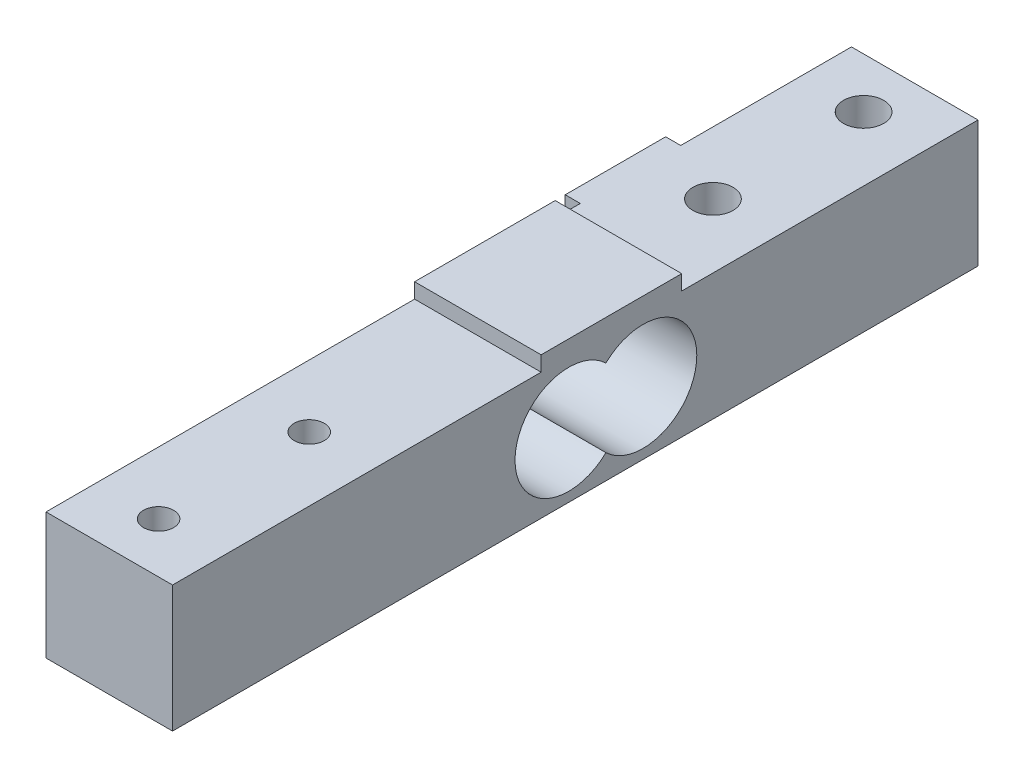
ISO-10303-21;
HEADER;
FILE_DESCRIPTION(('STEP AP214'),'2;1');
FILE_NAME('part.step','',(''),(''),'','','');
FILE_SCHEMA(('AUTOMOTIVE_DESIGN { 1 0 10303 214 1 1 1 1 }'));
ENDSEC;
DATA;
#1=APPLICATION_CONTEXT('core data for automotive mechanical design processes');
#2=APPLICATION_PROTOCOL_DEFINITION('international standard','automotive_design',2000,#1);
#3=PRODUCT_CONTEXT('',#1,'mechanical');
#4=PRODUCT('Part','Part','',(#3));
#5=PRODUCT_RELATED_PRODUCT_CATEGORY('part','',(#4));
#6=PRODUCT_DEFINITION_FORMATION('','',#4);
#7=PRODUCT_DEFINITION_CONTEXT('part definition',#1,'design');
#8=PRODUCT_DEFINITION('design','',#6,#7);
#9=PRODUCT_DEFINITION_SHAPE('','',#8);
#10=(LENGTH_UNIT() NAMED_UNIT(*) SI_UNIT(.MILLI.,.METRE.));
#11=(NAMED_UNIT(*) PLANE_ANGLE_UNIT() SI_UNIT($,.RADIAN.));
#12=(NAMED_UNIT(*) SI_UNIT($,.STERADIAN.) SOLID_ANGLE_UNIT());
#13=UNCERTAINTY_MEASURE_WITH_UNIT(LENGTH_MEASURE(1.E-05),#10,'distance_accuracy_value','');
#14=(GEOMETRIC_REPRESENTATION_CONTEXT(3) GLOBAL_UNCERTAINTY_ASSIGNED_CONTEXT((#13)) GLOBAL_UNIT_ASSIGNED_CONTEXT((#10,
#11,#12)) REPRESENTATION_CONTEXT('',''));
#15=CARTESIAN_POINT('',(0.,0.,0.));
#16=DIRECTION('',(0.,0.,1.));
#17=DIRECTION('',(1.,0.,0.));
#18=AXIS2_PLACEMENT_3D('',#15,#16,#17);
#19=CARTESIAN_POINT('',(0.,0.,80.2));
#20=DIRECTION('',(1.,0.,0.));
#21=DIRECTION('',(0.,1.,0.));
#22=AXIS2_PLACEMENT_3D('',#19,#20,#21);
#23=PLANE('',#22);
#24=CARTESIAN_POINT('',(0.,6.3,33.35));
#25=DIRECTION('',(1.,0.,0.));
#26=DIRECTION('',(0.,1.,0.));
#27=AXIS2_PLACEMENT_3D('',#24,#25,#26);
#28=CIRCLE('',#27,5.35);
#29=CARTESIAN_POINT('',(0.,2.43574069193074,37.05));
#30=VERTEX_POINT('',#29);
#31=CARTESIAN_POINT('',(0.,10.1642593080693,37.05));
#32=VERTEX_POINT('',#31);
#33=EDGE_CURVE('E264',#30,#32,#28,.T.);
#34=ORIENTED_EDGE('',*,*,#33,.T.);
#35=CARTESIAN_POINT('',(0.,6.3,40.75));
#36=DIRECTION('',(1.,0.,0.));
#37=DIRECTION('',(0.,1.,0.));
#38=AXIS2_PLACEMENT_3D('',#35,#36,#37);
#39=CIRCLE('',#38,5.35);
#40=EDGE_CURVE('E261',#32,#30,#39,.T.);
#41=ORIENTED_EDGE('',*,*,#40,.T.);
#42=EDGE_LOOP('',(#34,#41));
#43=FACE_BOUND('',#42,.T.);
#44=DIRECTION('',(0.,1.,0.));
#45=VECTOR('',#44,1.);
#46=CARTESIAN_POINT('',(0.,12.6,27.));
#47=LINE('',#46,#45);
#48=CARTESIAN_POINT('',(0.,0.,27.));
#49=VERTEX_POINT('',#48);
#50=CARTESIAN_POINT('',(0.,12.6,27.));
#51=VERTEX_POINT('',#50);
#52=EDGE_CURVE('E155',#49,#51,#47,.T.);
#53=ORIENTED_EDGE('',*,*,#52,.F.);
#54=DIRECTION('',(0.,0.,-1.));
#55=VECTOR('',#54,1.);
#56=CARTESIAN_POINT('',(0.,0.,80.2));
#57=LINE('',#56,#55);
#58=CARTESIAN_POINT('',(0.,0.,80.2));
#59=VERTEX_POINT('',#58);
#60=EDGE_CURVE('E11',#59,#49,#57,.T.);
#61=ORIENTED_EDGE('',*,*,#60,.F.);
#62=DIRECTION('',(0.,-1.,0.));
#63=VECTOR('',#62,1.);
#64=CARTESIAN_POINT('',(0.,0.,80.2));
#65=LINE('',#64,#63);
#66=CARTESIAN_POINT('',(0.,12.6,80.2));
#67=VERTEX_POINT('',#66);
#68=EDGE_CURVE('E198',#67,#59,#65,.T.);
#69=ORIENTED_EDGE('',*,*,#68,.F.);
#70=DIRECTION('',(0.,0.,-1.));
#71=VECTOR('',#70,1.);
#72=CARTESIAN_POINT('',(0.,12.6,80.2));
#73=LINE('',#72,#71);
#74=CARTESIAN_POINT('',(0.,12.6,43.5));
#75=VERTEX_POINT('',#74);
#76=EDGE_CURVE('E201',#67,#75,#73,.T.);
#77=ORIENTED_EDGE('',*,*,#76,.T.);
#78=DIRECTION('',(0.,-1.,0.));
#79=VECTOR('',#78,1.);
#80=CARTESIAN_POINT('',(0.,14.1,43.5));
#81=LINE('',#80,#79);
#82=CARTESIAN_POINT('',(0.,14.1,43.5));
#83=VERTEX_POINT('',#82);
#84=EDGE_CURVE('E242',#83,#75,#81,.T.);
#85=ORIENTED_EDGE('',*,*,#84,.F.);
#86=DIRECTION('',(0.,0.,1.));
#87=VECTOR('',#86,1.);
#88=CARTESIAN_POINT('',(0.,14.1,43.5));
#89=LINE('',#88,#87);
#90=CARTESIAN_POINT('',(0.,14.1,29.5));
#91=VERTEX_POINT('',#90);
#92=EDGE_CURVE('E327',#91,#83,#89,.T.);
#93=ORIENTED_EDGE('',*,*,#92,.F.);
#94=DIRECTION('',(0.,-1.,0.));
#95=VECTOR('',#94,1.);
#96=CARTESIAN_POINT('',(0.,14.1,29.5));
#97=LINE('',#96,#95);
#98=CARTESIAN_POINT('',(0.,12.6,29.5));
#99=VERTEX_POINT('',#98);
#100=EDGE_CURVE('E244',#91,#99,#97,.T.);
#101=ORIENTED_EDGE('',*,*,#100,.T.);
#102=EDGE_CURVE('E56',#99,#51,#73,.T.);
#103=ORIENTED_EDGE('',*,*,#102,.T.);
#104=EDGE_LOOP('',(#53,#61,#69,#77,#85,#93,#101,#103));
#105=FACE_BOUND('',#104,.T.);
#106=ADVANCED_FACE('F32',(#43,#105),#23,.F.);
#107=DIRECTION('',(0.,-1.,0.));
#108=VECTOR('',#107,1.);
#109=CARTESIAN_POINT('',(0.,12.6,17.));
#110=LINE('',#109,#108);
#111=CARTESIAN_POINT('',(0.,12.6,17.));
#112=VERTEX_POINT('',#111);
#113=CARTESIAN_POINT('',(0.,0.,17.));
#114=VERTEX_POINT('',#113);
#115=EDGE_CURVE('E48',#112,#114,#110,.T.);
#116=ORIENTED_EDGE('',*,*,#115,.F.);
#117=CARTESIAN_POINT('',(0.,12.6,0.));
#118=VERTEX_POINT('',#117);
#119=EDGE_CURVE('E181',#112,#118,#73,.T.);
#120=ORIENTED_EDGE('',*,*,#119,.T.);
#121=DIRECTION('',(0.,-1.,0.));
#122=VECTOR('',#121,1.);
#123=CARTESIAN_POINT('',(0.,0.,0.));
#124=LINE('',#123,#122);
#125=CARTESIAN_POINT('',(0.,0.,0.));
#126=VERTEX_POINT('',#125);
#127=EDGE_CURVE('E218',#118,#126,#124,.T.);
#128=ORIENTED_EDGE('',*,*,#127,.T.);
#129=EDGE_CURVE('E40',#114,#126,#57,.T.);
#130=ORIENTED_EDGE('',*,*,#129,.F.);
#131=EDGE_LOOP('',(#116,#120,#128,#130));
#132=FACE_BOUND('',#131,.T.);
#133=ADVANCED_FACE('F306',(#132),#23,.F.);
#134=CARTESIAN_POINT('',(0.,12.6,80.2));
#135=DIRECTION('',(0.,-1.,0.));
#136=DIRECTION('',(0.,0.,-1.));
#137=AXIS2_PLACEMENT_3D('',#134,#135,#136);
#138=PLANE('',#137);
#139=CARTESIAN_POINT('',(6.20845831409421,12.6,75.2));
#140=DIRECTION('',(0.,1.,0.));
#141=DIRECTION('',(0.,0.,1.));
#142=AXIS2_PLACEMENT_3D('',#139,#140,#141);
#143=CIRCLE('',#142,1.5);
#144=CARTESIAN_POINT('',(6.20845831409421,12.6,76.7));
#145=VERTEX_POINT('',#144);
#146=EDGE_CURVE('E212',#145,#145,#143,.T.);
#147=ORIENTED_EDGE('',*,*,#146,.F.);
#148=EDGE_LOOP('',(#147));
#149=FACE_BOUND('',#148,.T.);
#150=CARTESIAN_POINT('',(6.20845831409421,12.6,60.2));
#151=DIRECTION('',(0.,1.,0.));
#152=DIRECTION('',(0.,0.,1.));
#153=AXIS2_PLACEMENT_3D('',#150,#151,#152);
#154=CIRCLE('',#153,1.5);
#155=CARTESIAN_POINT('',(6.20845831409421,12.6,61.7));
#156=VERTEX_POINT('',#155);
#157=EDGE_CURVE('E288',#156,#156,#154,.T.);
#158=ORIENTED_EDGE('',*,*,#157,.F.);
#159=EDGE_LOOP('',(#158));
#160=FACE_BOUND('',#159,.T.);
#161=DIRECTION('',(1.,0.,0.));
#162=VECTOR('',#161,1.);
#163=CARTESIAN_POINT('',(12.6,12.6,43.5));
#164=LINE('',#163,#162);
#165=CARTESIAN_POINT('',(12.6,12.6,43.5));
#166=VERTEX_POINT('',#165);
#167=EDGE_CURVE('E159',#75,#166,#164,.T.);
#168=ORIENTED_EDGE('',*,*,#167,.F.);
#169=ORIENTED_EDGE('',*,*,#76,.F.);
#170=DIRECTION('',(-1.,0.,0.));
#171=VECTOR('',#170,1.);
#172=CARTESIAN_POINT('',(0.,12.6,80.2));
#173=LINE('',#172,#171);
#174=CARTESIAN_POINT('',(12.6,12.6,80.2));
#175=VERTEX_POINT('',#174);
#176=EDGE_CURVE('E216',#175,#67,#173,.T.);
#177=ORIENTED_EDGE('',*,*,#176,.F.);
#178=DIRECTION('',(0.,0.,-1.));
#179=VECTOR('',#178,1.);
#180=CARTESIAN_POINT('',(12.6,12.6,80.2));
#181=LINE('',#180,#179);
#182=EDGE_CURVE('E312',#175,#166,#181,.T.);
#183=ORIENTED_EDGE('',*,*,#182,.T.);
#184=EDGE_LOOP('',(#168,#169,#177,#183));
#185=FACE_BOUND('',#184,.T.);
#186=ADVANCED_FACE('F303',(#149,#160,#185),#138,.F.);
#187=CARTESIAN_POINT('',(6.20845831409421,12.6,20.));
#188=DIRECTION('',(0.,1.,0.));
#189=DIRECTION('',(0.,0.,1.));
#190=AXIS2_PLACEMENT_3D('',#187,#188,#189);
#191=CIRCLE('',#190,2.);
#192=CARTESIAN_POINT('',(6.20845831409421,12.6,22.));
#193=VERTEX_POINT('',#192);
#194=EDGE_CURVE('E282',#193,#193,#191,.T.);
#195=ORIENTED_EDGE('',*,*,#194,.F.);
#196=EDGE_LOOP('',(#195));
#197=FACE_BOUND('',#196,.T.);
#198=CARTESIAN_POINT('',(6.20845831409421,12.6,5.));
#199=DIRECTION('',(0.,1.,0.));
#200=DIRECTION('',(0.,0.,1.));
#201=AXIS2_PLACEMENT_3D('',#198,#199,#200);
#202=CIRCLE('',#201,2.);
#203=CARTESIAN_POINT('',(6.20845831409421,12.6,7.));
#204=VERTEX_POINT('',#203);
#205=EDGE_CURVE('E276',#204,#204,#202,.T.);
#206=ORIENTED_EDGE('',*,*,#205,.F.);
#207=EDGE_LOOP('',(#206));
#208=FACE_BOUND('',#207,.T.);
#209=DIRECTION('',(-1.,0.,0.));
#210=VECTOR('',#209,1.);
#211=CARTESIAN_POINT('',(12.6,12.6,29.5));
#212=LINE('',#211,#210);
#213=CARTESIAN_POINT('',(12.6,12.6,29.5));
#214=VERTEX_POINT('',#213);
#215=EDGE_CURVE('E156',#214,#99,#212,.T.);
#216=ORIENTED_EDGE('',*,*,#215,.F.);
#217=CARTESIAN_POINT('',(12.6,12.6,0.));
#218=VERTEX_POINT('',#217);
#219=EDGE_CURVE('E235',#214,#218,#181,.T.);
#220=ORIENTED_EDGE('',*,*,#219,.T.);
#221=DIRECTION('',(-1.,0.,0.));
#222=VECTOR('',#221,1.);
#223=CARTESIAN_POINT('',(0.,12.6,0.));
#224=LINE('',#223,#222);
#225=EDGE_CURVE('E204',#218,#118,#224,.T.);
#226=ORIENTED_EDGE('',*,*,#225,.T.);
#227=ORIENTED_EDGE('',*,*,#119,.F.);
#228=DIRECTION('',(1.,0.,0.));
#229=VECTOR('',#228,1.);
#230=CARTESIAN_POINT('',(-1.5,12.6,17.));
#231=LINE('',#230,#229);
#232=CARTESIAN_POINT('',(-1.5,12.6,17.));
#233=VERTEX_POINT('',#232);
#234=EDGE_CURVE('E140',#233,#112,#231,.T.);
#235=ORIENTED_EDGE('',*,*,#234,.F.);
#236=DIRECTION('',(0.,0.,-1.));
#237=VECTOR('',#236,1.);
#238=CARTESIAN_POINT('',(-1.5,12.6,27.));
#239=LINE('',#238,#237);
#240=CARTESIAN_POINT('',(-1.5,12.6,27.));
#241=VERTEX_POINT('',#240);
#242=EDGE_CURVE('E133',#241,#233,#239,.T.);
#243=ORIENTED_EDGE('',*,*,#242,.F.);
#244=DIRECTION('',(1.,0.,0.));
#245=VECTOR('',#244,1.);
#246=CARTESIAN_POINT('',(-1.5,12.6,27.));
#247=LINE('',#246,#245);
#248=EDGE_CURVE('E137',#241,#51,#247,.T.);
#249=ORIENTED_EDGE('',*,*,#248,.T.);
#250=ORIENTED_EDGE('',*,*,#102,.F.);
#251=EDGE_LOOP('',(#216,#220,#226,#227,#235,#243,#249,#250));
#252=FACE_BOUND('',#251,.T.);
#253=ADVANCED_FACE('F135',(#197,#208,#252),#138,.F.);
#254=CARTESIAN_POINT('',(0.,0.,80.2));
#255=DIRECTION('',(0.,1.,0.));
#256=DIRECTION('',(0.,0.,1.));
#257=AXIS2_PLACEMENT_3D('',#254,#255,#256);
#258=PLANE('',#257);
#259=CARTESIAN_POINT('',(6.20845831409421,0.,5.));
#260=DIRECTION('',(0.,1.,0.));
#261=DIRECTION('',(0.,0.,1.));
#262=AXIS2_PLACEMENT_3D('',#259,#260,#261);
#263=CIRCLE('',#262,2.);
#264=CARTESIAN_POINT('',(6.20845831409421,0.,7.));
#265=VERTEX_POINT('',#264);
#266=EDGE_CURVE('E279',#265,#265,#263,.T.);
#267=ORIENTED_EDGE('',*,*,#266,.T.);
#268=EDGE_LOOP('',(#267));
#269=FACE_BOUND('',#268,.T.);
#270=CARTESIAN_POINT('',(6.20845831409421,0.,20.));
#271=DIRECTION('',(0.,1.,0.));
#272=DIRECTION('',(0.,0.,1.));
#273=AXIS2_PLACEMENT_3D('',#270,#271,#272);
#274=CIRCLE('',#273,2.);
#275=CARTESIAN_POINT('',(6.20845831409421,0.,22.));
#276=VERTEX_POINT('',#275);
#277=EDGE_CURVE('E285',#276,#276,#274,.T.);
#278=ORIENTED_EDGE('',*,*,#277,.T.);
#279=EDGE_LOOP('',(#278));
#280=FACE_BOUND('',#279,.T.);
#281=CARTESIAN_POINT('',(6.20845831409421,0.,60.2));
#282=DIRECTION('',(0.,1.,0.));
#283=DIRECTION('',(0.,0.,1.));
#284=AXIS2_PLACEMENT_3D('',#281,#282,#283);
#285=CIRCLE('',#284,1.5);
#286=CARTESIAN_POINT('',(6.20845831409421,0.,61.7));
#287=VERTEX_POINT('',#286);
#288=EDGE_CURVE('E291',#287,#287,#285,.T.);
#289=ORIENTED_EDGE('',*,*,#288,.T.);
#290=EDGE_LOOP('',(#289));
#291=FACE_BOUND('',#290,.T.);
#292=CARTESIAN_POINT('',(6.20845831409421,0.,75.2));
#293=DIRECTION('',(0.,1.,0.));
#294=DIRECTION('',(0.,0.,1.));
#295=AXIS2_PLACEMENT_3D('',#292,#293,#294);
#296=CIRCLE('',#295,1.5);
#297=CARTESIAN_POINT('',(6.20845831409421,0.,76.7));
#298=VERTEX_POINT('',#297);
#299=EDGE_CURVE('E222',#298,#298,#296,.T.);
#300=ORIENTED_EDGE('',*,*,#299,.T.);
#301=EDGE_LOOP('',(#300));
#302=FACE_BOUND('',#301,.T.);
#303=DIRECTION('',(1.,0.,0.));
#304=VECTOR('',#303,1.);
#305=CARTESIAN_POINT('',(0.,0.,0.));
#306=LINE('',#305,#304);
#307=CARTESIAN_POINT('',(12.6,0.,0.));
#308=VERTEX_POINT('',#307);
#309=EDGE_CURVE('E221',#126,#308,#306,.T.);
#310=ORIENTED_EDGE('',*,*,#309,.T.);
#311=DIRECTION('',(0.,0.,-1.));
#312=VECTOR('',#311,1.);
#313=CARTESIAN_POINT('',(12.6,0.,80.2));
#314=LINE('',#313,#312);
#315=CARTESIAN_POINT('',(12.6,0.,80.2));
#316=VERTEX_POINT('',#315);
#317=EDGE_CURVE('E237',#316,#308,#314,.T.);
#318=ORIENTED_EDGE('',*,*,#317,.F.);
#319=DIRECTION('',(1.,0.,0.));
#320=VECTOR('',#319,1.);
#321=CARTESIAN_POINT('',(0.,0.,80.2));
#322=LINE('',#321,#320);
#323=EDGE_CURVE('E194',#59,#316,#322,.T.);
#324=ORIENTED_EDGE('',*,*,#323,.F.);
#325=ORIENTED_EDGE('',*,*,#60,.T.);
#326=DIRECTION('',(1.,0.,0.));
#327=VECTOR('',#326,1.);
#328=CARTESIAN_POINT('',(-1.5,0.,27.));
#329=LINE('',#328,#327);
#330=CARTESIAN_POINT('',(-1.5,0.,27.));
#331=VERTEX_POINT('',#330);
#332=EDGE_CURVE('E169',#331,#49,#329,.T.);
#333=ORIENTED_EDGE('',*,*,#332,.F.);
#334=DIRECTION('',(0.,0.,1.));
#335=VECTOR('',#334,1.);
#336=CARTESIAN_POINT('',(-1.5,0.,27.));
#337=LINE('',#336,#335);
#338=CARTESIAN_POINT('',(-1.5,0.,17.));
#339=VERTEX_POINT('',#338);
#340=EDGE_CURVE('E149',#339,#331,#337,.T.);
#341=ORIENTED_EDGE('',*,*,#340,.F.);
#342=DIRECTION('',(1.,0.,0.));
#343=VECTOR('',#342,1.);
#344=CARTESIAN_POINT('',(-1.5,0.,17.));
#345=LINE('',#344,#343);
#346=EDGE_CURVE('E161',#339,#114,#345,.T.);
#347=ORIENTED_EDGE('',*,*,#346,.T.);
#348=ORIENTED_EDGE('',*,*,#129,.T.);
#349=EDGE_LOOP('',(#310,#318,#324,#325,#333,#341,#347,#348));
#350=FACE_BOUND('',#349,.T.);
#351=ADVANCED_FACE('F191',(#269,#280,#291,#302,#350),#258,.F.);
#352=CARTESIAN_POINT('',(12.6,0.,80.2));
#353=DIRECTION('',(-1.,0.,0.));
#354=DIRECTION('',(0.,-1.,0.));
#355=AXIS2_PLACEMENT_3D('',#352,#353,#354);
#356=PLANE('',#355);
#357=CARTESIAN_POINT('',(12.6,6.3,33.35));
#358=DIRECTION('',(1.,0.,0.));
#359=DIRECTION('',(0.,1.,0.));
#360=AXIS2_PLACEMENT_3D('',#357,#358,#359);
#361=CIRCLE('',#360,5.35);
#362=CARTESIAN_POINT('',(12.6,2.43574069193074,37.05));
#363=VERTEX_POINT('',#362);
#364=CARTESIAN_POINT('',(12.6,10.1642593080693,37.05));
#365=VERTEX_POINT('',#364);
#366=EDGE_CURVE('E265',#363,#365,#361,.T.);
#367=ORIENTED_EDGE('',*,*,#366,.F.);
#368=CARTESIAN_POINT('',(12.6,6.3,40.75));
#369=DIRECTION('',(1.,0.,0.));
#370=DIRECTION('',(0.,1.,0.));
#371=AXIS2_PLACEMENT_3D('',#368,#369,#370);
#372=CIRCLE('',#371,5.35);
#373=EDGE_CURVE('E269',#365,#363,#372,.T.);
#374=ORIENTED_EDGE('',*,*,#373,.F.);
#375=EDGE_LOOP('',(#367,#374));
#376=FACE_BOUND('',#375,.T.);
#377=DIRECTION('',(0.,1.,0.));
#378=VECTOR('',#377,1.);
#379=CARTESIAN_POINT('',(12.6,0.,0.));
#380=LINE('',#379,#378);
#381=EDGE_CURVE('E209',#308,#218,#380,.T.);
#382=ORIENTED_EDGE('',*,*,#381,.T.);
#383=ORIENTED_EDGE('',*,*,#219,.F.);
#384=DIRECTION('',(0.,-1.,0.));
#385=VECTOR('',#384,1.);
#386=CARTESIAN_POINT('',(12.6,14.1,29.5));
#387=LINE('',#386,#385);
#388=CARTESIAN_POINT('',(12.6,14.1,29.5));
#389=VERTEX_POINT('',#388);
#390=EDGE_CURVE('E271',#389,#214,#387,.T.);
#391=ORIENTED_EDGE('',*,*,#390,.F.);
#392=DIRECTION('',(0.,0.,-1.));
#393=VECTOR('',#392,1.);
#394=CARTESIAN_POINT('',(12.6,14.1,43.5));
#395=LINE('',#394,#393);
#396=CARTESIAN_POINT('',(12.6,14.1,43.5));
#397=VERTEX_POINT('',#396);
#398=EDGE_CURVE('E176',#397,#389,#395,.T.);
#399=ORIENTED_EDGE('',*,*,#398,.F.);
#400=DIRECTION('',(0.,-1.,0.));
#401=VECTOR('',#400,1.);
#402=CARTESIAN_POINT('',(12.6,14.1,43.5));
#403=LINE('',#402,#401);
#404=EDGE_CURVE('E245',#397,#166,#403,.T.);
#405=ORIENTED_EDGE('',*,*,#404,.T.);
#406=ORIENTED_EDGE('',*,*,#182,.F.);
#407=DIRECTION('',(0.,1.,0.));
#408=VECTOR('',#407,1.);
#409=CARTESIAN_POINT('',(12.6,0.,80.2));
#410=LINE('',#409,#408);
#411=EDGE_CURVE('E206',#316,#175,#410,.T.);
#412=ORIENTED_EDGE('',*,*,#411,.F.);
#413=ORIENTED_EDGE('',*,*,#317,.T.);
#414=EDGE_LOOP('',(#382,#383,#391,#399,#405,#406,#412,#413));
#415=FACE_BOUND('',#414,.T.);
#416=ADVANCED_FACE('F319',(#376,#415),#356,.F.);
#417=CARTESIAN_POINT('',(0.,0.,80.2));
#418=DIRECTION('',(0.,0.,-1.));
#419=DIRECTION('',(-1.,0.,0.));
#420=AXIS2_PLACEMENT_3D('',#417,#418,#419);
#421=PLANE('',#420);
#422=ORIENTED_EDGE('',*,*,#68,.T.);
#423=ORIENTED_EDGE('',*,*,#323,.T.);
#424=ORIENTED_EDGE('',*,*,#411,.T.);
#425=ORIENTED_EDGE('',*,*,#176,.T.);
#426=EDGE_LOOP('',(#422,#423,#424,#425));
#427=FACE_BOUND('',#426,.T.);
#428=ADVANCED_FACE('F368',(#427),#421,.F.);
#429=CARTESIAN_POINT('',(0.,0.,0.));
#430=DIRECTION('',(0.,0.,-1.));
#431=DIRECTION('',(-1.,0.,0.));
#432=AXIS2_PLACEMENT_3D('',#429,#430,#431);
#433=PLANE('',#432);
#434=ORIENTED_EDGE('',*,*,#127,.F.);
#435=ORIENTED_EDGE('',*,*,#225,.F.);
#436=ORIENTED_EDGE('',*,*,#381,.F.);
#437=ORIENTED_EDGE('',*,*,#309,.F.);
#438=EDGE_LOOP('',(#434,#435,#436,#437));
#439=FACE_BOUND('',#438,.T.);
#440=ADVANCED_FACE('F342',(#439),#433,.T.);
#441=CARTESIAN_POINT('',(6.20845831409421,0.,75.2));
#442=DIRECTION('',(0.,1.,0.));
#443=DIRECTION('',(0.,0.,1.));
#444=AXIS2_PLACEMENT_3D('',#441,#442,#443);
#445=CYLINDRICAL_SURFACE('',#444,1.5);
#446=ORIENTED_EDGE('',*,*,#299,.F.);
#447=EDGE_LOOP('',(#446));
#448=FACE_BOUND('',#447,.T.);
#449=ORIENTED_EDGE('',*,*,#146,.T.);
#450=EDGE_LOOP('',(#449));
#451=FACE_BOUND('',#450,.T.);
#452=ADVANCED_FACE('F301',(#448,#451),#445,.F.);
#453=CARTESIAN_POINT('',(6.20845831409421,0.,60.2));
#454=DIRECTION('',(0.,1.,0.));
#455=DIRECTION('',(0.,0.,1.));
#456=AXIS2_PLACEMENT_3D('',#453,#454,#455);
#457=CYLINDRICAL_SURFACE('',#456,1.5);
#458=ORIENTED_EDGE('',*,*,#288,.F.);
#459=EDGE_LOOP('',(#458));
#460=FACE_BOUND('',#459,.T.);
#461=ORIENTED_EDGE('',*,*,#157,.T.);
#462=EDGE_LOOP('',(#461));
#463=FACE_BOUND('',#462,.T.);
#464=ADVANCED_FACE('F381',(#460,#463),#457,.F.);
#465=CARTESIAN_POINT('',(6.20845831409421,0.,20.));
#466=DIRECTION('',(0.,1.,0.));
#467=DIRECTION('',(0.,0.,1.));
#468=AXIS2_PLACEMENT_3D('',#465,#466,#467);
#469=CYLINDRICAL_SURFACE('',#468,2.);
#470=ORIENTED_EDGE('',*,*,#277,.F.);
#471=EDGE_LOOP('',(#470));
#472=FACE_BOUND('',#471,.T.);
#473=ORIENTED_EDGE('',*,*,#194,.T.);
#474=EDGE_LOOP('',(#473));
#475=FACE_BOUND('',#474,.T.);
#476=ADVANCED_FACE('F385',(#472,#475),#469,.F.);
#477=CARTESIAN_POINT('',(6.20845831409421,0.,5.));
#478=DIRECTION('',(0.,1.,0.));
#479=DIRECTION('',(0.,0.,1.));
#480=AXIS2_PLACEMENT_3D('',#477,#478,#479);
#481=CYLINDRICAL_SURFACE('',#480,2.);
#482=ORIENTED_EDGE('',*,*,#266,.F.);
#483=EDGE_LOOP('',(#482));
#484=FACE_BOUND('',#483,.T.);
#485=ORIENTED_EDGE('',*,*,#205,.T.);
#486=EDGE_LOOP('',(#485));
#487=FACE_BOUND('',#486,.T.);
#488=ADVANCED_FACE('F389',(#484,#487),#481,.F.);
#489=CARTESIAN_POINT('',(0.,6.3,40.75));
#490=DIRECTION('',(1.,0.,0.));
#491=DIRECTION('',(0.,1.,0.));
#492=AXIS2_PLACEMENT_3D('',#489,#490,#491);
#493=CYLINDRICAL_SURFACE('',#492,5.35);
#494=ORIENTED_EDGE('',*,*,#373,.T.);
#495=DIRECTION('',(1.,0.,0.));
#496=VECTOR('',#495,1.);
#497=CARTESIAN_POINT('',(0.,2.43574069193074,37.05));
#498=LINE('',#497,#496);
#499=EDGE_CURVE('E268',#30,#363,#498,.T.);
#500=ORIENTED_EDGE('',*,*,#499,.F.);
#501=ORIENTED_EDGE('',*,*,#40,.F.);
#502=DIRECTION('',(1.,0.,0.));
#503=VECTOR('',#502,1.);
#504=CARTESIAN_POINT('',(0.,10.1642593080693,37.05));
#505=LINE('',#504,#503);
#506=EDGE_CURVE('E274',#32,#365,#505,.T.);
#507=ORIENTED_EDGE('',*,*,#506,.T.);
#508=EDGE_LOOP('',(#494,#500,#501,#507));
#509=FACE_BOUND('',#508,.T.);
#510=ADVANCED_FACE('F353',(#509),#493,.F.);
#511=CARTESIAN_POINT('',(0.,6.3,33.35));
#512=DIRECTION('',(1.,0.,0.));
#513=DIRECTION('',(0.,1.,0.));
#514=AXIS2_PLACEMENT_3D('',#511,#512,#513);
#515=CYLINDRICAL_SURFACE('',#514,5.35);
#516=ORIENTED_EDGE('',*,*,#366,.T.);
#517=ORIENTED_EDGE('',*,*,#506,.F.);
#518=ORIENTED_EDGE('',*,*,#33,.F.);
#519=ORIENTED_EDGE('',*,*,#499,.T.);
#520=EDGE_LOOP('',(#516,#517,#518,#519));
#521=FACE_BOUND('',#520,.T.);
#522=ADVANCED_FACE('F346',(#521),#515,.F.);
#523=CARTESIAN_POINT('',(12.6,14.1,29.5));
#524=DIRECTION('',(0.,0.,1.));
#525=DIRECTION('',(1.,0.,0.));
#526=AXIS2_PLACEMENT_3D('',#523,#524,#525);
#527=PLANE('',#526);
#528=ORIENTED_EDGE('',*,*,#215,.T.);
#529=ORIENTED_EDGE('',*,*,#100,.F.);
#530=DIRECTION('',(-1.,0.,0.));
#531=VECTOR('',#530,1.);
#532=CARTESIAN_POINT('',(12.6,14.1,29.5));
#533=LINE('',#532,#531);
#534=EDGE_CURVE('E326',#389,#91,#533,.T.);
#535=ORIENTED_EDGE('',*,*,#534,.F.);
#536=ORIENTED_EDGE('',*,*,#390,.T.);
#537=EDGE_LOOP('',(#528,#529,#535,#536));
#538=FACE_BOUND('',#537,.T.);
#539=ADVANCED_FACE('F344',(#538),#527,.F.);
#540=CARTESIAN_POINT('',(12.6,14.1,43.5));
#541=DIRECTION('',(0.,0.,-1.));
#542=DIRECTION('',(-1.,0.,0.));
#543=AXIS2_PLACEMENT_3D('',#540,#541,#542);
#544=PLANE('',#543);
#545=ORIENTED_EDGE('',*,*,#167,.T.);
#546=ORIENTED_EDGE('',*,*,#404,.F.);
#547=DIRECTION('',(1.,0.,0.));
#548=VECTOR('',#547,1.);
#549=CARTESIAN_POINT('',(12.6,14.1,43.5));
#550=LINE('',#549,#548);
#551=EDGE_CURVE('E250',#83,#397,#550,.T.);
#552=ORIENTED_EDGE('',*,*,#551,.F.);
#553=ORIENTED_EDGE('',*,*,#84,.T.);
#554=EDGE_LOOP('',(#545,#546,#552,#553));
#555=FACE_BOUND('',#554,.T.);
#556=ADVANCED_FACE('F315',(#555),#544,.F.);
#557=CARTESIAN_POINT('',(0.,14.1,0.));
#558=DIRECTION('',(0.,1.,0.));
#559=DIRECTION('',(0.,0.,1.));
#560=AXIS2_PLACEMENT_3D('',#557,#558,#559);
#561=PLANE('',#560);
#562=ORIENTED_EDGE('',*,*,#398,.T.);
#563=ORIENTED_EDGE('',*,*,#534,.T.);
#564=ORIENTED_EDGE('',*,*,#92,.T.);
#565=ORIENTED_EDGE('',*,*,#551,.T.);
#566=EDGE_LOOP('',(#562,#563,#564,#565));
#567=FACE_BOUND('',#566,.T.);
#568=ADVANCED_FACE('F330',(#567),#561,.T.);
#569=CARTESIAN_POINT('',(-1.5,12.6,27.));
#570=DIRECTION('',(0.,0.,-1.));
#571=DIRECTION('',(-1.,0.,0.));
#572=AXIS2_PLACEMENT_3D('',#569,#570,#571);
#573=PLANE('',#572);
#574=ORIENTED_EDGE('',*,*,#52,.T.);
#575=ORIENTED_EDGE('',*,*,#248,.F.);
#576=DIRECTION('',(0.,1.,0.));
#577=VECTOR('',#576,1.);
#578=CARTESIAN_POINT('',(-1.5,12.6,27.));
#579=LINE('',#578,#577);
#580=EDGE_CURVE('E144',#331,#241,#579,.T.);
#581=ORIENTED_EDGE('',*,*,#580,.F.);
#582=ORIENTED_EDGE('',*,*,#332,.T.);
#583=EDGE_LOOP('',(#574,#575,#581,#582));
#584=FACE_BOUND('',#583,.T.);
#585=ADVANCED_FACE('F154',(#584),#573,.F.);
#586=CARTESIAN_POINT('',(-1.5,12.6,17.));
#587=DIRECTION('',(0.,0.,1.));
#588=DIRECTION('',(1.,0.,0.));
#589=AXIS2_PLACEMENT_3D('',#586,#587,#588);
#590=PLANE('',#589);
#591=ORIENTED_EDGE('',*,*,#115,.T.);
#592=ORIENTED_EDGE('',*,*,#346,.F.);
#593=DIRECTION('',(0.,-1.,0.));
#594=VECTOR('',#593,1.);
#595=CARTESIAN_POINT('',(-1.5,12.6,17.));
#596=LINE('',#595,#594);
#597=EDGE_CURVE('E143',#233,#339,#596,.T.);
#598=ORIENTED_EDGE('',*,*,#597,.F.);
#599=ORIENTED_EDGE('',*,*,#234,.T.);
#600=EDGE_LOOP('',(#591,#592,#598,#599));
#601=FACE_BOUND('',#600,.T.);
#602=ADVANCED_FACE('F190',(#601),#590,.F.);
#603=CARTESIAN_POINT('',(-1.5,0.,0.));
#604=DIRECTION('',(1.,0.,0.));
#605=DIRECTION('',(0.,1.,0.));
#606=AXIS2_PLACEMENT_3D('',#603,#604,#605);
#607=PLANE('',#606);
#608=ORIENTED_EDGE('',*,*,#580,.T.);
#609=ORIENTED_EDGE('',*,*,#242,.T.);
#610=ORIENTED_EDGE('',*,*,#597,.T.);
#611=ORIENTED_EDGE('',*,*,#340,.T.);
#612=EDGE_LOOP('',(#608,#609,#610,#611));
#613=FACE_BOUND('',#612,.T.);
#614=ADVANCED_FACE('F147',(#613),#607,.F.);
#615=CLOSED_SHELL('',(#106,#133,#186,#253,#351,#416,#428,#440,#452,#464,#476,#488,#510,#522,
#539,#556,#568,#585,#602,#614));
#616=MANIFOLD_SOLID_BREP('B2',#615);
#617=ADVANCED_BREP_SHAPE_REPRESENTATION('',(#18,#616),#14);
#618=SHAPE_DEFINITION_REPRESENTATION(#9,#617);
ENDSEC;
END-ISO-10303-21;
